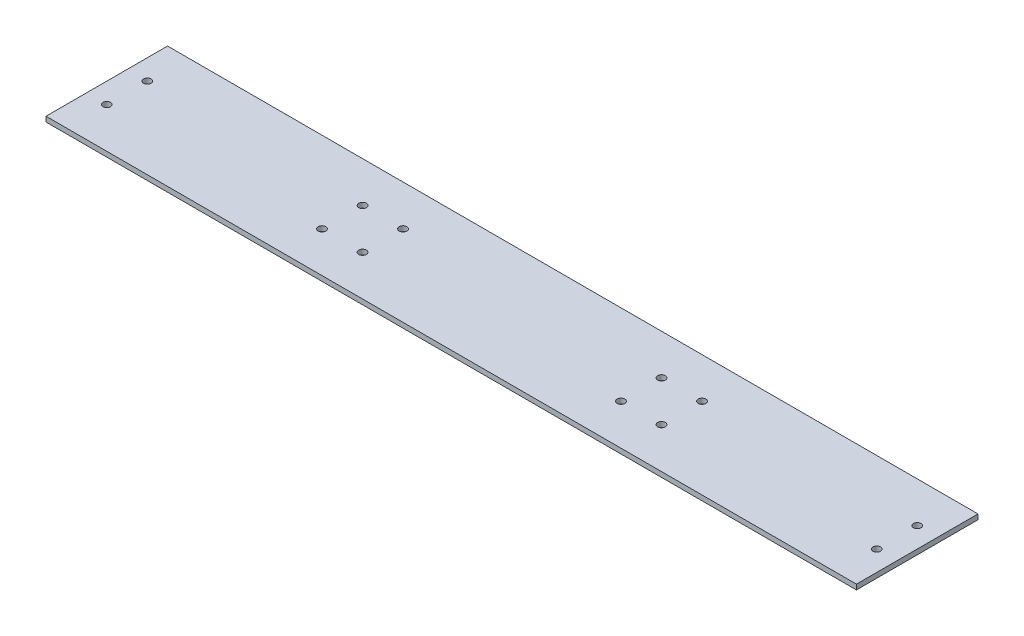
ISO-10303-21;
HEADER;
FILE_DESCRIPTION(('STEP AP214'),'2;1');
FILE_NAME('part.step','',(''),(''),'','','');
FILE_SCHEMA(('AUTOMOTIVE_DESIGN { 1 0 10303 214 1 1 1 1 }'));
ENDSEC;
DATA;
#1=APPLICATION_CONTEXT('core data for automotive mechanical design processes');
#2=APPLICATION_PROTOCOL_DEFINITION('international standard','automotive_design',2000,#1);
#3=PRODUCT_CONTEXT('',#1,'mechanical');
#4=PRODUCT('Part','Part','',(#3));
#5=PRODUCT_RELATED_PRODUCT_CATEGORY('part','',(#4));
#6=PRODUCT_DEFINITION_FORMATION('','',#4);
#7=PRODUCT_DEFINITION_CONTEXT('part definition',#1,'design');
#8=PRODUCT_DEFINITION('design','',#6,#7);
#9=PRODUCT_DEFINITION_SHAPE('','',#8);
#10=(LENGTH_UNIT() NAMED_UNIT(*) SI_UNIT(.MILLI.,.METRE.));
#11=(NAMED_UNIT(*) PLANE_ANGLE_UNIT() SI_UNIT($,.RADIAN.));
#12=(NAMED_UNIT(*) SI_UNIT($,.STERADIAN.) SOLID_ANGLE_UNIT());
#13=UNCERTAINTY_MEASURE_WITH_UNIT(LENGTH_MEASURE(1.E-05),#10,'distance_accuracy_value','');
#14=(GEOMETRIC_REPRESENTATION_CONTEXT(3) GLOBAL_UNCERTAINTY_ASSIGNED_CONTEXT((#13)) GLOBAL_UNIT_ASSIGNED_CONTEXT((#10,
#11,#12)) REPRESENTATION_CONTEXT('',''));
#15=CARTESIAN_POINT('',(0.,0.,0.));
#16=DIRECTION('',(0.,0.,1.));
#17=DIRECTION('',(1.,0.,0.));
#18=AXIS2_PLACEMENT_3D('',#15,#16,#17);
#19=CARTESIAN_POINT('',(-254.,3.175,38.1));
#20=DIRECTION('',(1.,0.,0.));
#21=DIRECTION('',(0.,0.,-1.));
#22=AXIS2_PLACEMENT_3D('',#19,#20,#21);
#23=PLANE('',#22);
#24=DIRECTION('',(0.,0.,1.));
#25=VECTOR('',#24,1.);
#26=CARTESIAN_POINT('',(-254.,0.,38.1));
#27=LINE('',#26,#25);
#28=CARTESIAN_POINT('',(-254.,0.,-38.1));
#29=VERTEX_POINT('',#28);
#30=CARTESIAN_POINT('',(-254.,0.,38.1));
#31=VERTEX_POINT('',#30);
#32=EDGE_CURVE('E95',#29,#31,#27,.T.);
#33=ORIENTED_EDGE('',*,*,#32,.T.);
#34=DIRECTION('',(0.,-1.,0.));
#35=VECTOR('',#34,1.);
#36=CARTESIAN_POINT('',(-254.,3.175,38.1));
#37=LINE('',#36,#35);
#38=CARTESIAN_POINT('',(-254.,3.175,38.1));
#39=VERTEX_POINT('',#38);
#40=EDGE_CURVE('E11',#39,#31,#37,.T.);
#41=ORIENTED_EDGE('',*,*,#40,.F.);
#42=DIRECTION('',(0.,0.,1.));
#43=VECTOR('',#42,1.);
#44=CARTESIAN_POINT('',(-254.,3.175,38.1));
#45=LINE('',#44,#43);
#46=CARTESIAN_POINT('',(-254.,3.175,-38.1));
#47=VERTEX_POINT('',#46);
#48=EDGE_CURVE('E83',#47,#39,#45,.T.);
#49=ORIENTED_EDGE('',*,*,#48,.F.);
#50=DIRECTION('',(0.,-1.,0.));
#51=VECTOR('',#50,1.);
#52=CARTESIAN_POINT('',(-254.,3.175,-38.1));
#53=LINE('',#52,#51);
#54=EDGE_CURVE('E91',#47,#29,#53,.T.);
#55=ORIENTED_EDGE('',*,*,#54,.T.);
#56=EDGE_LOOP('',(#33,#41,#49,#55));
#57=FACE_BOUND('',#56,.T.);
#58=ADVANCED_FACE('F32',(#57),#23,.F.);
#59=CARTESIAN_POINT('',(254.,3.175,38.1));
#60=DIRECTION('',(0.,0.,-1.));
#61=DIRECTION('',(-1.,0.,0.));
#62=AXIS2_PLACEMENT_3D('',#59,#60,#61);
#63=PLANE('',#62);
#64=DIRECTION('',(1.,0.,0.));
#65=VECTOR('',#64,1.);
#66=CARTESIAN_POINT('',(254.,0.,38.1));
#67=LINE('',#66,#65);
#68=CARTESIAN_POINT('',(254.,0.,38.1));
#69=VERTEX_POINT('',#68);
#70=EDGE_CURVE('E87',#31,#69,#67,.T.);
#71=ORIENTED_EDGE('',*,*,#70,.T.);
#72=DIRECTION('',(0.,-1.,0.));
#73=VECTOR('',#72,1.);
#74=CARTESIAN_POINT('',(254.,3.175,38.1));
#75=LINE('',#74,#73);
#76=CARTESIAN_POINT('',(254.,3.175,38.1));
#77=VERTEX_POINT('',#76);
#78=EDGE_CURVE('E40',#77,#69,#75,.T.);
#79=ORIENTED_EDGE('',*,*,#78,.F.);
#80=DIRECTION('',(1.,0.,0.));
#81=VECTOR('',#80,1.);
#82=CARTESIAN_POINT('',(254.,3.175,38.1));
#83=LINE('',#82,#81);
#84=EDGE_CURVE('E78',#39,#77,#83,.T.);
#85=ORIENTED_EDGE('',*,*,#84,.F.);
#86=ORIENTED_EDGE('',*,*,#40,.T.);
#87=EDGE_LOOP('',(#71,#79,#85,#86));
#88=FACE_BOUND('',#87,.T.);
#89=ADVANCED_FACE('F86',(#88),#63,.F.);
#90=CARTESIAN_POINT('',(254.,3.175,38.1));
#91=DIRECTION('',(-1.,0.,0.));
#92=DIRECTION('',(0.,0.,1.));
#93=AXIS2_PLACEMENT_3D('',#90,#91,#92);
#94=PLANE('',#93);
#95=DIRECTION('',(0.,0.,-1.));
#96=VECTOR('',#95,1.);
#97=CARTESIAN_POINT('',(254.,0.,38.1));
#98=LINE('',#97,#96);
#99=CARTESIAN_POINT('',(254.,0.,-38.1));
#100=VERTEX_POINT('',#99);
#101=EDGE_CURVE('E65',#69,#100,#98,.T.);
#102=ORIENTED_EDGE('',*,*,#101,.T.);
#103=DIRECTION('',(0.,-1.,0.));
#104=VECTOR('',#103,1.);
#105=CARTESIAN_POINT('',(254.,3.175,-38.1));
#106=LINE('',#105,#104);
#107=CARTESIAN_POINT('',(254.,3.175,-38.1));
#108=VERTEX_POINT('',#107);
#109=EDGE_CURVE('E88',#108,#100,#106,.T.);
#110=ORIENTED_EDGE('',*,*,#109,.F.);
#111=DIRECTION('',(0.,0.,-1.));
#112=VECTOR('',#111,1.);
#113=CARTESIAN_POINT('',(254.,3.175,38.1));
#114=LINE('',#113,#112);
#115=EDGE_CURVE('E81',#77,#108,#114,.T.);
#116=ORIENTED_EDGE('',*,*,#115,.F.);
#117=ORIENTED_EDGE('',*,*,#78,.T.);
#118=EDGE_LOOP('',(#102,#110,#116,#117));
#119=FACE_BOUND('',#118,.T.);
#120=ADVANCED_FACE('F89',(#119),#94,.F.);
#121=CARTESIAN_POINT('',(254.,3.175,-38.1));
#122=DIRECTION('',(0.,0.,1.));
#123=DIRECTION('',(1.,0.,0.));
#124=AXIS2_PLACEMENT_3D('',#121,#122,#123);
#125=PLANE('',#124);
#126=DIRECTION('',(-1.,0.,0.));
#127=VECTOR('',#126,1.);
#128=CARTESIAN_POINT('',(254.,0.,-38.1));
#129=LINE('',#128,#127);
#130=EDGE_CURVE('E71',#100,#29,#129,.T.);
#131=ORIENTED_EDGE('',*,*,#130,.T.);
#132=ORIENTED_EDGE('',*,*,#54,.F.);
#133=DIRECTION('',(-1.,0.,0.));
#134=VECTOR('',#133,1.);
#135=CARTESIAN_POINT('',(254.,3.175,-38.1));
#136=LINE('',#135,#134);
#137=EDGE_CURVE('E48',#108,#47,#136,.T.);
#138=ORIENTED_EDGE('',*,*,#137,.F.);
#139=ORIENTED_EDGE('',*,*,#109,.T.);
#140=EDGE_LOOP('',(#131,#132,#138,#139));
#141=FACE_BOUND('',#140,.T.);
#142=ADVANCED_FACE('F103',(#141),#125,.F.);
#143=CARTESIAN_POINT('',(0.,3.175,0.));
#144=DIRECTION('',(0.,1.,0.));
#145=DIRECTION('',(0.,0.,1.));
#146=AXIS2_PLACEMENT_3D('',#143,#144,#145);
#147=PLANE('',#146);
#148=CARTESIAN_POINT('',(241.3,3.175,-12.7000000000001));
#149=DIRECTION('',(0.,1.,0.));
#150=DIRECTION('',(0.,0.,-1.));
#151=AXIS2_PLACEMENT_3D('',#148,#149,#150);
#152=CIRCLE('',#151,2.38125000000001);
#153=CARTESIAN_POINT('',(241.3,3.175,-15.0812500000001));
#154=VERTEX_POINT('',#153);
#155=EDGE_CURVE('E163',#154,#154,#152,.T.);
#156=ORIENTED_EDGE('',*,*,#155,.F.);
#157=EDGE_LOOP('',(#156));
#158=FACE_BOUND('',#157,.T.);
#159=CARTESIAN_POINT('',(241.3,3.175,12.7));
#160=DIRECTION('',(0.,1.,0.));
#161=DIRECTION('',(0.,0.,-1.));
#162=AXIS2_PLACEMENT_3D('',#159,#160,#161);
#163=CIRCLE('',#162,2.38125000000001);
#164=CARTESIAN_POINT('',(241.3,3.175,10.31875));
#165=VERTEX_POINT('',#164);
#166=EDGE_CURVE('E169',#165,#165,#163,.T.);
#167=ORIENTED_EDGE('',*,*,#166,.F.);
#168=EDGE_LOOP('',(#167));
#169=FACE_BOUND('',#168,.T.);
#170=CARTESIAN_POINT('',(-241.3,3.175,12.7));
#171=DIRECTION('',(0.,1.,0.));
#172=DIRECTION('',(0.,0.,1.));
#173=AXIS2_PLACEMENT_3D('',#170,#171,#172);
#174=CIRCLE('',#173,2.38125000000001);
#175=CARTESIAN_POINT('',(-241.3,3.175,15.08125));
#176=VERTEX_POINT('',#175);
#177=EDGE_CURVE('E175',#176,#176,#174,.T.);
#178=ORIENTED_EDGE('',*,*,#177,.F.);
#179=EDGE_LOOP('',(#178));
#180=FACE_BOUND('',#179,.T.);
#181=CARTESIAN_POINT('',(-241.3,3.175,-12.7));
#182=DIRECTION('',(0.,1.,0.));
#183=DIRECTION('',(0.,0.,1.));
#184=AXIS2_PLACEMENT_3D('',#181,#182,#183);
#185=CIRCLE('',#184,2.38125000000001);
#186=CARTESIAN_POINT('',(-241.3,3.175,-10.31875));
#187=VERTEX_POINT('',#186);
#188=EDGE_CURVE('E157',#187,#187,#185,.T.);
#189=ORIENTED_EDGE('',*,*,#188,.F.);
#190=EDGE_LOOP('',(#189));
#191=FACE_BOUND('',#190,.T.);
#192=CARTESIAN_POINT('',(-106.339909648921,3.175,-12.6614992113058));
#193=DIRECTION('',(0.,1.,0.));
#194=DIRECTION('',(0.,0.,1.));
#195=AXIS2_PLACEMENT_3D('',#192,#193,#194);
#196=CIRCLE('',#195,2.41299999999999);
#197=CARTESIAN_POINT('',(-106.339909648921,3.175,-10.2484992113058));
#198=VERTEX_POINT('',#197);
#199=EDGE_CURVE('E134',#198,#198,#196,.T.);
#200=ORIENTED_EDGE('',*,*,#199,.F.);
#201=EDGE_LOOP('',(#200));
#202=FACE_BOUND('',#201,.T.);
#203=CARTESIAN_POINT('',(-80.9399096489211,3.175,-12.6614992113059));
#204=DIRECTION('',(0.,1.,0.));
#205=DIRECTION('',(0.,0.,1.));
#206=AXIS2_PLACEMENT_3D('',#203,#204,#205);
#207=CIRCLE('',#206,2.41299999999999);
#208=CARTESIAN_POINT('',(-80.9399096489211,3.175,-10.2484992113059));
#209=VERTEX_POINT('',#208);
#210=EDGE_CURVE('E128',#209,#209,#207,.T.);
#211=ORIENTED_EDGE('',*,*,#210,.F.);
#212=EDGE_LOOP('',(#211));
#213=FACE_BOUND('',#212,.T.);
#214=CARTESIAN_POINT('',(-80.939909648921,3.175,12.7385007886941));
#215=DIRECTION('',(0.,1.,0.));
#216=DIRECTION('',(0.,0.,1.));
#217=AXIS2_PLACEMENT_3D('',#214,#215,#216);
#218=CIRCLE('',#217,2.41299999999999);
#219=CARTESIAN_POINT('',(-80.939909648921,3.175,15.1515007886941));
#220=VERTEX_POINT('',#219);
#221=EDGE_CURVE('E122',#220,#220,#218,.T.);
#222=ORIENTED_EDGE('',*,*,#221,.F.);
#223=EDGE_LOOP('',(#222));
#224=FACE_BOUND('',#223,.T.);
#225=CARTESIAN_POINT('',(106.338702734643,3.175,12.6203745281518));
#226=DIRECTION('',(0.,1.,0.));
#227=DIRECTION('',(0.,0.,1.));
#228=AXIS2_PLACEMENT_3D('',#225,#226,#227);
#229=CIRCLE('',#228,2.41299999999998);
#230=CARTESIAN_POINT('',(106.338702734643,3.175,15.0333745281518));
#231=VERTEX_POINT('',#230);
#232=EDGE_CURVE('E115',#231,#231,#229,.T.);
#233=ORIENTED_EDGE('',*,*,#232,.F.);
#234=EDGE_LOOP('',(#233));
#235=FACE_BOUND('',#234,.T.);
#236=CARTESIAN_POINT('',(106.338702734643,3.175,-12.7796254718482));
#237=DIRECTION('',(0.,1.,0.));
#238=DIRECTION('',(0.,0.,1.));
#239=AXIS2_PLACEMENT_3D('',#236,#237,#238);
#240=CIRCLE('',#239,2.41299999999999);
#241=CARTESIAN_POINT('',(106.338702734643,3.175,-10.3666254718482));
#242=VERTEX_POINT('',#241);
#243=EDGE_CURVE('E152',#242,#242,#240,.T.);
#244=ORIENTED_EDGE('',*,*,#243,.F.);
#245=EDGE_LOOP('',(#244));
#246=FACE_BOUND('',#245,.T.);
#247=CARTESIAN_POINT('',(80.9387027346431,3.175,-12.7796254718481));
#248=DIRECTION('',(0.,1.,0.));
#249=DIRECTION('',(0.,0.,1.));
#250=AXIS2_PLACEMENT_3D('',#247,#248,#249);
#251=CIRCLE('',#250,2.41299999999999);
#252=CARTESIAN_POINT('',(80.9387027346431,3.175,-10.3666254718481));
#253=VERTEX_POINT('',#252);
#254=EDGE_CURVE('E146',#253,#253,#251,.T.);
#255=ORIENTED_EDGE('',*,*,#254,.F.);
#256=EDGE_LOOP('',(#255));
#257=FACE_BOUND('',#256,.T.);
#258=CARTESIAN_POINT('',(80.9387027346432,3.175,12.6203745281519));
#259=DIRECTION('',(0.,1.,0.));
#260=DIRECTION('',(0.,0.,1.));
#261=AXIS2_PLACEMENT_3D('',#258,#259,#260);
#262=CIRCLE('',#261,2.41299999999998);
#263=CARTESIAN_POINT('',(80.9387027346432,3.175,15.0333745281519));
#264=VERTEX_POINT('',#263);
#265=EDGE_CURVE('E139',#264,#264,#262,.T.);
#266=ORIENTED_EDGE('',*,*,#265,.F.);
#267=EDGE_LOOP('',(#266));
#268=FACE_BOUND('',#267,.T.);
#269=CARTESIAN_POINT('',(-106.339909648921,3.175,12.7385007886942));
#270=DIRECTION('',(0.,1.,0.));
#271=DIRECTION('',(0.,0.,1.));
#272=AXIS2_PLACEMENT_3D('',#269,#270,#271);
#273=CIRCLE('',#272,2.41299999999999);
#274=CARTESIAN_POINT('',(-106.339909648921,3.175,15.1515007886942));
#275=VERTEX_POINT('',#274);
#276=EDGE_CURVE('E109',#275,#275,#273,.T.);
#277=ORIENTED_EDGE('',*,*,#276,.F.);
#278=EDGE_LOOP('',(#277));
#279=FACE_BOUND('',#278,.T.);
#280=ORIENTED_EDGE('',*,*,#48,.T.);
#281=ORIENTED_EDGE('',*,*,#84,.T.);
#282=ORIENTED_EDGE('',*,*,#115,.T.);
#283=ORIENTED_EDGE('',*,*,#137,.T.);
#284=EDGE_LOOP('',(#280,#281,#282,#283));
#285=FACE_BOUND('',#284,.T.);
#286=ADVANCED_FACE('F79',(#158,#169,#180,#191,#202,#213,#224,#235,#246,#257,#268,#279,#285),
#147,.T.);
#287=CARTESIAN_POINT('',(0.,0.,0.));
#288=DIRECTION('',(0.,1.,0.));
#289=DIRECTION('',(0.,0.,1.));
#290=AXIS2_PLACEMENT_3D('',#287,#288,#289);
#291=PLANE('',#290);
#292=CARTESIAN_POINT('',(241.3,0.,-12.7000000000001));
#293=DIRECTION('',(0.,1.,0.));
#294=DIRECTION('',(0.,0.,-1.));
#295=AXIS2_PLACEMENT_3D('',#292,#293,#294);
#296=CIRCLE('',#295,2.38125000000001);
#297=CARTESIAN_POINT('',(241.3,0.,-15.0812500000001));
#298=VERTEX_POINT('',#297);
#299=EDGE_CURVE('E166',#298,#298,#296,.T.);
#300=ORIENTED_EDGE('',*,*,#299,.T.);
#301=EDGE_LOOP('',(#300));
#302=FACE_BOUND('',#301,.T.);
#303=CARTESIAN_POINT('',(241.3,0.,12.7));
#304=DIRECTION('',(0.,1.,0.));
#305=DIRECTION('',(0.,0.,-1.));
#306=AXIS2_PLACEMENT_3D('',#303,#304,#305);
#307=CIRCLE('',#306,2.38125000000001);
#308=CARTESIAN_POINT('',(241.3,0.,10.31875));
#309=VERTEX_POINT('',#308);
#310=EDGE_CURVE('E172',#309,#309,#307,.T.);
#311=ORIENTED_EDGE('',*,*,#310,.T.);
#312=EDGE_LOOP('',(#311));
#313=FACE_BOUND('',#312,.T.);
#314=CARTESIAN_POINT('',(-241.3,0.,12.7));
#315=DIRECTION('',(0.,1.,0.));
#316=DIRECTION('',(0.,0.,1.));
#317=AXIS2_PLACEMENT_3D('',#314,#315,#316);
#318=CIRCLE('',#317,2.38125000000001);
#319=CARTESIAN_POINT('',(-241.3,0.,15.08125));
#320=VERTEX_POINT('',#319);
#321=EDGE_CURVE('E160',#320,#320,#318,.T.);
#322=ORIENTED_EDGE('',*,*,#321,.T.);
#323=EDGE_LOOP('',(#322));
#324=FACE_BOUND('',#323,.T.);
#325=CARTESIAN_POINT('',(-241.3,0.,-12.7));
#326=DIRECTION('',(0.,1.,0.));
#327=DIRECTION('',(0.,0.,1.));
#328=AXIS2_PLACEMENT_3D('',#325,#326,#327);
#329=CIRCLE('',#328,2.38125000000001);
#330=CARTESIAN_POINT('',(-241.3,0.,-10.31875));
#331=VERTEX_POINT('',#330);
#332=EDGE_CURVE('E143',#331,#331,#329,.T.);
#333=ORIENTED_EDGE('',*,*,#332,.T.);
#334=EDGE_LOOP('',(#333));
#335=FACE_BOUND('',#334,.T.);
#336=CARTESIAN_POINT('',(-106.339909648921,0.,-12.6614992113058));
#337=DIRECTION('',(0.,1.,0.));
#338=DIRECTION('',(0.,0.,1.));
#339=AXIS2_PLACEMENT_3D('',#336,#337,#338);
#340=CIRCLE('',#339,2.41299999999999);
#341=CARTESIAN_POINT('',(-106.339909648921,0.,-10.2484992113058));
#342=VERTEX_POINT('',#341);
#343=EDGE_CURVE('E112',#342,#342,#340,.T.);
#344=ORIENTED_EDGE('',*,*,#343,.T.);
#345=EDGE_LOOP('',(#344));
#346=FACE_BOUND('',#345,.T.);
#347=CARTESIAN_POINT('',(-80.9399096489211,0.,-12.6614992113059));
#348=DIRECTION('',(0.,1.,0.));
#349=DIRECTION('',(0.,0.,1.));
#350=AXIS2_PLACEMENT_3D('',#347,#348,#349);
#351=CIRCLE('',#350,2.41299999999999);
#352=CARTESIAN_POINT('',(-80.9399096489211,0.,-10.2484992113059));
#353=VERTEX_POINT('',#352);
#354=EDGE_CURVE('E131',#353,#353,#351,.T.);
#355=ORIENTED_EDGE('',*,*,#354,.T.);
#356=EDGE_LOOP('',(#355));
#357=FACE_BOUND('',#356,.T.);
#358=CARTESIAN_POINT('',(-80.939909648921,0.,12.7385007886941));
#359=DIRECTION('',(0.,1.,0.));
#360=DIRECTION('',(0.,0.,1.));
#361=AXIS2_PLACEMENT_3D('',#358,#359,#360);
#362=CIRCLE('',#361,2.41299999999999);
#363=CARTESIAN_POINT('',(-80.939909648921,0.,15.1515007886941));
#364=VERTEX_POINT('',#363);
#365=EDGE_CURVE('E125',#364,#364,#362,.T.);
#366=ORIENTED_EDGE('',*,*,#365,.T.);
#367=EDGE_LOOP('',(#366));
#368=FACE_BOUND('',#367,.T.);
#369=CARTESIAN_POINT('',(106.338702734643,0.,12.6203745281518));
#370=DIRECTION('',(0.,1.,0.));
#371=DIRECTION('',(0.,0.,1.));
#372=AXIS2_PLACEMENT_3D('',#369,#370,#371);
#373=CIRCLE('',#372,2.41299999999998);
#374=CARTESIAN_POINT('',(106.338702734643,0.,15.0333745281518));
#375=VERTEX_POINT('',#374);
#376=EDGE_CURVE('E118',#375,#375,#373,.T.);
#377=ORIENTED_EDGE('',*,*,#376,.T.);
#378=EDGE_LOOP('',(#377));
#379=FACE_BOUND('',#378,.T.);
#380=CARTESIAN_POINT('',(106.338702734643,0.,-12.7796254718482));
#381=DIRECTION('',(0.,1.,0.));
#382=DIRECTION('',(0.,0.,1.));
#383=AXIS2_PLACEMENT_3D('',#380,#381,#382);
#384=CIRCLE('',#383,2.41299999999999);
#385=CARTESIAN_POINT('',(106.338702734643,0.,-10.3666254718482));
#386=VERTEX_POINT('',#385);
#387=EDGE_CURVE('E119',#386,#386,#384,.T.);
#388=ORIENTED_EDGE('',*,*,#387,.T.);
#389=EDGE_LOOP('',(#388));
#390=FACE_BOUND('',#389,.T.);
#391=CARTESIAN_POINT('',(80.9387027346431,0.,-12.7796254718481));
#392=DIRECTION('',(0.,1.,0.));
#393=DIRECTION('',(0.,0.,1.));
#394=AXIS2_PLACEMENT_3D('',#391,#392,#393);
#395=CIRCLE('',#394,2.41299999999999);
#396=CARTESIAN_POINT('',(80.9387027346431,0.,-10.3666254718481));
#397=VERTEX_POINT('',#396);
#398=EDGE_CURVE('E149',#397,#397,#395,.T.);
#399=ORIENTED_EDGE('',*,*,#398,.T.);
#400=EDGE_LOOP('',(#399));
#401=FACE_BOUND('',#400,.T.);
#402=CARTESIAN_POINT('',(80.9387027346432,0.,12.6203745281519));
#403=DIRECTION('',(0.,1.,0.));
#404=DIRECTION('',(0.,0.,1.));
#405=AXIS2_PLACEMENT_3D('',#402,#403,#404);
#406=CIRCLE('',#405,2.41299999999998);
#407=CARTESIAN_POINT('',(80.9387027346432,0.,15.0333745281519));
#408=VERTEX_POINT('',#407);
#409=EDGE_CURVE('E142',#408,#408,#406,.T.);
#410=ORIENTED_EDGE('',*,*,#409,.T.);
#411=EDGE_LOOP('',(#410));
#412=FACE_BOUND('',#411,.T.);
#413=CARTESIAN_POINT('',(-106.339909648921,0.,12.7385007886942));
#414=DIRECTION('',(0.,1.,0.));
#415=DIRECTION('',(0.,0.,1.));
#416=AXIS2_PLACEMENT_3D('',#413,#414,#415);
#417=CIRCLE('',#416,2.41299999999999);
#418=CARTESIAN_POINT('',(-106.339909648921,0.,15.1515007886942));
#419=VERTEX_POINT('',#418);
#420=EDGE_CURVE('E98',#419,#419,#417,.T.);
#421=ORIENTED_EDGE('',*,*,#420,.T.);
#422=EDGE_LOOP('',(#421));
#423=FACE_BOUND('',#422,.T.);
#424=ORIENTED_EDGE('',*,*,#32,.F.);
#425=ORIENTED_EDGE('',*,*,#130,.F.);
#426=ORIENTED_EDGE('',*,*,#101,.F.);
#427=ORIENTED_EDGE('',*,*,#70,.F.);
#428=EDGE_LOOP('',(#424,#425,#426,#427));
#429=FACE_BOUND('',#428,.T.);
#430=ADVANCED_FACE('F106',(#302,#313,#324,#335,#346,#357,#368,#379,#390,#401,#412,#423,#429),
#291,.F.);
#431=CARTESIAN_POINT('',(-106.339909648921,0.,12.7385007886942));
#432=DIRECTION('',(0.,1.,0.));
#433=DIRECTION('',(0.,0.,1.));
#434=AXIS2_PLACEMENT_3D('',#431,#432,#433);
#435=CYLINDRICAL_SURFACE('',#434,2.41299999999999);
#436=ORIENTED_EDGE('',*,*,#420,.F.);
#437=EDGE_LOOP('',(#436));
#438=FACE_BOUND('',#437,.T.);
#439=ORIENTED_EDGE('',*,*,#276,.T.);
#440=EDGE_LOOP('',(#439));
#441=FACE_BOUND('',#440,.T.);
#442=ADVANCED_FACE('F213',(#438,#441),#435,.F.);
#443=CARTESIAN_POINT('',(80.9387027346432,0.,12.6203745281519));
#444=DIRECTION('',(0.,1.,0.));
#445=DIRECTION('',(0.,0.,1.));
#446=AXIS2_PLACEMENT_3D('',#443,#444,#445);
#447=CYLINDRICAL_SURFACE('',#446,2.41299999999998);
#448=ORIENTED_EDGE('',*,*,#409,.F.);
#449=EDGE_LOOP('',(#448));
#450=FACE_BOUND('',#449,.T.);
#451=ORIENTED_EDGE('',*,*,#265,.T.);
#452=EDGE_LOOP('',(#451));
#453=FACE_BOUND('',#452,.T.);
#454=ADVANCED_FACE('F215',(#450,#453),#447,.F.);
#455=CARTESIAN_POINT('',(80.9387027346431,0.,-12.7796254718481));
#456=DIRECTION('',(0.,1.,0.));
#457=DIRECTION('',(0.,0.,1.));
#458=AXIS2_PLACEMENT_3D('',#455,#456,#457);
#459=CYLINDRICAL_SURFACE('',#458,2.41299999999999);
#460=ORIENTED_EDGE('',*,*,#398,.F.);
#461=EDGE_LOOP('',(#460));
#462=FACE_BOUND('',#461,.T.);
#463=ORIENTED_EDGE('',*,*,#254,.T.);
#464=EDGE_LOOP('',(#463));
#465=FACE_BOUND('',#464,.T.);
#466=ADVANCED_FACE('F222',(#462,#465),#459,.F.);
#467=CARTESIAN_POINT('',(106.338702734643,0.,-12.7796254718482));
#468=DIRECTION('',(0.,1.,0.));
#469=DIRECTION('',(0.,0.,1.));
#470=AXIS2_PLACEMENT_3D('',#467,#468,#469);
#471=CYLINDRICAL_SURFACE('',#470,2.41299999999999);
#472=ORIENTED_EDGE('',*,*,#387,.F.);
#473=EDGE_LOOP('',(#472));
#474=FACE_BOUND('',#473,.T.);
#475=ORIENTED_EDGE('',*,*,#243,.T.);
#476=EDGE_LOOP('',(#475));
#477=FACE_BOUND('',#476,.T.);
#478=ADVANCED_FACE('F299',(#474,#477),#471,.F.);
#479=CARTESIAN_POINT('',(106.338702734643,0.,12.6203745281518));
#480=DIRECTION('',(0.,1.,0.));
#481=DIRECTION('',(0.,0.,1.));
#482=AXIS2_PLACEMENT_3D('',#479,#480,#481);
#483=CYLINDRICAL_SURFACE('',#482,2.41299999999998);
#484=ORIENTED_EDGE('',*,*,#376,.F.);
#485=EDGE_LOOP('',(#484));
#486=FACE_BOUND('',#485,.T.);
#487=ORIENTED_EDGE('',*,*,#232,.T.);
#488=EDGE_LOOP('',(#487));
#489=FACE_BOUND('',#488,.T.);
#490=ADVANCED_FACE('F302',(#486,#489),#483,.F.);
#491=CARTESIAN_POINT('',(-80.939909648921,0.,12.7385007886941));
#492=DIRECTION('',(0.,1.,0.));
#493=DIRECTION('',(0.,0.,1.));
#494=AXIS2_PLACEMENT_3D('',#491,#492,#493);
#495=CYLINDRICAL_SURFACE('',#494,2.41299999999999);
#496=ORIENTED_EDGE('',*,*,#365,.F.);
#497=EDGE_LOOP('',(#496));
#498=FACE_BOUND('',#497,.T.);
#499=ORIENTED_EDGE('',*,*,#221,.T.);
#500=EDGE_LOOP('',(#499));
#501=FACE_BOUND('',#500,.T.);
#502=ADVANCED_FACE('F312',(#498,#501),#495,.F.);
#503=CARTESIAN_POINT('',(-80.9399096489211,0.,-12.6614992113059));
#504=DIRECTION('',(0.,1.,0.));
#505=DIRECTION('',(0.,0.,1.));
#506=AXIS2_PLACEMENT_3D('',#503,#504,#505);
#507=CYLINDRICAL_SURFACE('',#506,2.41299999999999);
#508=ORIENTED_EDGE('',*,*,#354,.F.);
#509=EDGE_LOOP('',(#508));
#510=FACE_BOUND('',#509,.T.);
#511=ORIENTED_EDGE('',*,*,#210,.T.);
#512=EDGE_LOOP('',(#511));
#513=FACE_BOUND('',#512,.T.);
#514=ADVANCED_FACE('F308',(#510,#513),#507,.F.);
#515=CARTESIAN_POINT('',(-106.339909648921,0.,-12.6614992113058));
#516=DIRECTION('',(0.,1.,0.));
#517=DIRECTION('',(0.,0.,1.));
#518=AXIS2_PLACEMENT_3D('',#515,#516,#517);
#519=CYLINDRICAL_SURFACE('',#518,2.41299999999999);
#520=ORIENTED_EDGE('',*,*,#343,.F.);
#521=EDGE_LOOP('',(#520));
#522=FACE_BOUND('',#521,.T.);
#523=ORIENTED_EDGE('',*,*,#199,.T.);
#524=EDGE_LOOP('',(#523));
#525=FACE_BOUND('',#524,.T.);
#526=ADVANCED_FACE('F264',(#522,#525),#519,.F.);
#527=CARTESIAN_POINT('',(-241.3,0.,-12.7));
#528=DIRECTION('',(0.,1.,0.));
#529=DIRECTION('',(0.,0.,1.));
#530=AXIS2_PLACEMENT_3D('',#527,#528,#529);
#531=CYLINDRICAL_SURFACE('',#530,2.38125000000001);
#532=ORIENTED_EDGE('',*,*,#332,.F.);
#533=EDGE_LOOP('',(#532));
#534=FACE_BOUND('',#533,.T.);
#535=ORIENTED_EDGE('',*,*,#188,.T.);
#536=EDGE_LOOP('',(#535));
#537=FACE_BOUND('',#536,.T.);
#538=ADVANCED_FACE('F187',(#534,#537),#531,.F.);
#539=CARTESIAN_POINT('',(-241.3,0.,12.7));
#540=DIRECTION('',(0.,1.,0.));
#541=DIRECTION('',(0.,0.,1.));
#542=AXIS2_PLACEMENT_3D('',#539,#540,#541);
#543=CYLINDRICAL_SURFACE('',#542,2.38125000000001);
#544=ORIENTED_EDGE('',*,*,#321,.F.);
#545=EDGE_LOOP('',(#544));
#546=FACE_BOUND('',#545,.T.);
#547=ORIENTED_EDGE('',*,*,#177,.T.);
#548=EDGE_LOOP('',(#547));
#549=FACE_BOUND('',#548,.T.);
#550=ADVANCED_FACE('F183',(#546,#549),#543,.F.);
#551=CARTESIAN_POINT('',(241.3,0.,12.7));
#552=DIRECTION('',(0.,1.,0.));
#553=DIRECTION('',(0.,0.,1.));
#554=AXIS2_PLACEMENT_3D('',#551,#552,#553);
#555=CYLINDRICAL_SURFACE('',#554,2.38125000000001);
#556=ORIENTED_EDGE('',*,*,#310,.F.);
#557=EDGE_LOOP('',(#556));
#558=FACE_BOUND('',#557,.T.);
#559=ORIENTED_EDGE('',*,*,#166,.T.);
#560=EDGE_LOOP('',(#559));
#561=FACE_BOUND('',#560,.T.);
#562=ADVANCED_FACE('F186',(#558,#561),#555,.F.);
#563=CARTESIAN_POINT('',(241.3,0.,-12.7000000000001));
#564=DIRECTION('',(0.,1.,0.));
#565=DIRECTION('',(0.,0.,1.));
#566=AXIS2_PLACEMENT_3D('',#563,#564,#565);
#567=CYLINDRICAL_SURFACE('',#566,2.38125000000001);
#568=ORIENTED_EDGE('',*,*,#299,.F.);
#569=EDGE_LOOP('',(#568));
#570=FACE_BOUND('',#569,.T.);
#571=ORIENTED_EDGE('',*,*,#155,.T.);
#572=EDGE_LOOP('',(#571));
#573=FACE_BOUND('',#572,.T.);
#574=ADVANCED_FACE('F282',(#570,#573),#567,.F.);
#575=CLOSED_SHELL('',(#58,#89,#120,#142,#286,#430,#442,#454,#466,#478,#490,#502,#514,#526,#538,
#550,#562,#574));
#576=MANIFOLD_SOLID_BREP('B2',#575);
#577=ADVANCED_BREP_SHAPE_REPRESENTATION('',(#18,#576),#14);
#578=SHAPE_DEFINITION_REPRESENTATION(#9,#577);
ENDSEC;
END-ISO-10303-21;
